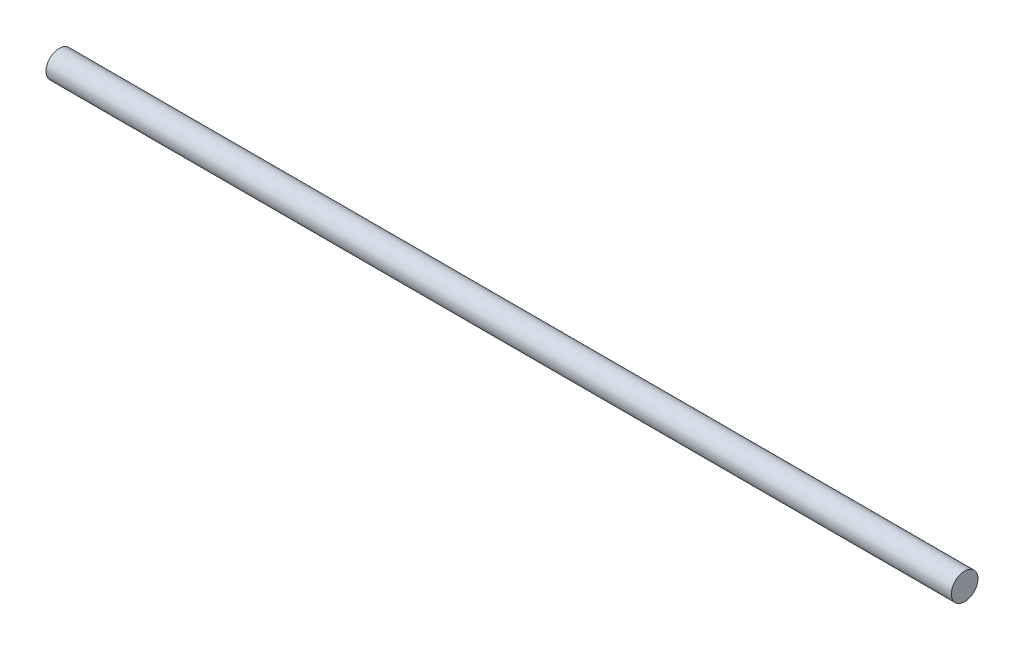
ISO-10303-21;
HEADER;
FILE_DESCRIPTION(('STEP AP214'),'2;1');
FILE_NAME('part.step','',(''),(''),'','','');
FILE_SCHEMA(('AUTOMOTIVE_DESIGN { 1 0 10303 214 1 1 1 1 }'));
ENDSEC;
DATA;
#1=APPLICATION_CONTEXT('core data for automotive mechanical design processes');
#2=APPLICATION_PROTOCOL_DEFINITION('international standard','automotive_design',2000,#1);
#3=PRODUCT_CONTEXT('',#1,'mechanical');
#4=PRODUCT('Part','Part','',(#3));
#5=PRODUCT_RELATED_PRODUCT_CATEGORY('part','',(#4));
#6=PRODUCT_DEFINITION_FORMATION('','',#4);
#7=PRODUCT_DEFINITION_CONTEXT('part definition',#1,'design');
#8=PRODUCT_DEFINITION('design','',#6,#7);
#9=PRODUCT_DEFINITION_SHAPE('','',#8);
#10=(LENGTH_UNIT() NAMED_UNIT(*) SI_UNIT(.MILLI.,.METRE.));
#11=(NAMED_UNIT(*) PLANE_ANGLE_UNIT() SI_UNIT($,.RADIAN.));
#12=(NAMED_UNIT(*) SI_UNIT($,.STERADIAN.) SOLID_ANGLE_UNIT());
#13=UNCERTAINTY_MEASURE_WITH_UNIT(LENGTH_MEASURE(1.E-05),#10,'distance_accuracy_value','');
#14=(GEOMETRIC_REPRESENTATION_CONTEXT(3) GLOBAL_UNCERTAINTY_ASSIGNED_CONTEXT((#13)) GLOBAL_UNIT_ASSIGNED_CONTEXT((#10,
#11,#12)) REPRESENTATION_CONTEXT('',''));
#15=CARTESIAN_POINT('',(0.,0.,0.));
#16=DIRECTION('',(0.,0.,1.));
#17=DIRECTION('',(1.,0.,0.));
#18=AXIS2_PLACEMENT_3D('',#15,#16,#17);
#19=CARTESIAN_POINT('',(2040.,0.,0.));
#20=DIRECTION('',(-1.,0.,0.));
#21=DIRECTION('',(0.,0.,1.));
#22=AXIS2_PLACEMENT_3D('',#19,#20,#21);
#23=CYLINDRICAL_SURFACE('',#22,60.0000000000001);
#24=CARTESIAN_POINT('',(2040.,0.,0.));
#25=DIRECTION('',(1.,0.,0.));
#26=DIRECTION('',(0.,0.,-1.));
#27=AXIS2_PLACEMENT_3D('',#24,#25,#26);
#28=CIRCLE('',#27,60.0000000000001);
#29=CARTESIAN_POINT('',(2040.,0.,-60.0000000000001));
#30=VERTEX_POINT('',#29);
#31=EDGE_CURVE('E10',#30,#30,#28,.T.);
#32=ORIENTED_EDGE('',*,*,#31,.F.);
#33=EDGE_LOOP('',(#32));
#34=FACE_BOUND('',#33,.T.);
#35=CARTESIAN_POINT('',(-2040.,0.,0.));
#36=DIRECTION('',(1.,0.,0.));
#37=DIRECTION('',(0.,0.,-1.));
#38=AXIS2_PLACEMENT_3D('',#35,#36,#37);
#39=CIRCLE('',#38,60.0000000000001);
#40=CARTESIAN_POINT('',(-2040.,0.,-60.0000000000001));
#41=VERTEX_POINT('',#40);
#42=EDGE_CURVE('E35',#41,#41,#39,.T.);
#43=ORIENTED_EDGE('',*,*,#42,.T.);
#44=EDGE_LOOP('',(#43));
#45=FACE_BOUND('',#44,.T.);
#46=ADVANCED_FACE('F32',(#34,#45),#23,.T.);
#47=CARTESIAN_POINT('',(2040.,0.,0.));
#48=DIRECTION('',(1.,0.,0.));
#49=DIRECTION('',(0.,0.,-1.));
#50=AXIS2_PLACEMENT_3D('',#47,#48,#49);
#51=PLANE('',#50);
#52=ORIENTED_EDGE('',*,*,#31,.T.);
#53=EDGE_LOOP('',(#52));
#54=FACE_BOUND('',#53,.T.);
#55=ADVANCED_FACE('F47',(#54),#51,.T.);
#56=CARTESIAN_POINT('',(-2040.,0.,0.));
#57=DIRECTION('',(1.,0.,0.));
#58=DIRECTION('',(0.,0.,-1.));
#59=AXIS2_PLACEMENT_3D('',#56,#57,#58);
#60=PLANE('',#59);
#61=ORIENTED_EDGE('',*,*,#42,.F.);
#62=EDGE_LOOP('',(#61));
#63=FACE_BOUND('',#62,.T.);
#64=ADVANCED_FACE('F45',(#63),#60,.F.);
#65=CLOSED_SHELL('',(#46,#55,#64));
#66=MANIFOLD_SOLID_BREP('B2',#65);
#67=ADVANCED_BREP_SHAPE_REPRESENTATION('',(#18,#66),#14);
#68=SHAPE_DEFINITION_REPRESENTATION(#9,#67);
ENDSEC;
END-ISO-10303-21;
